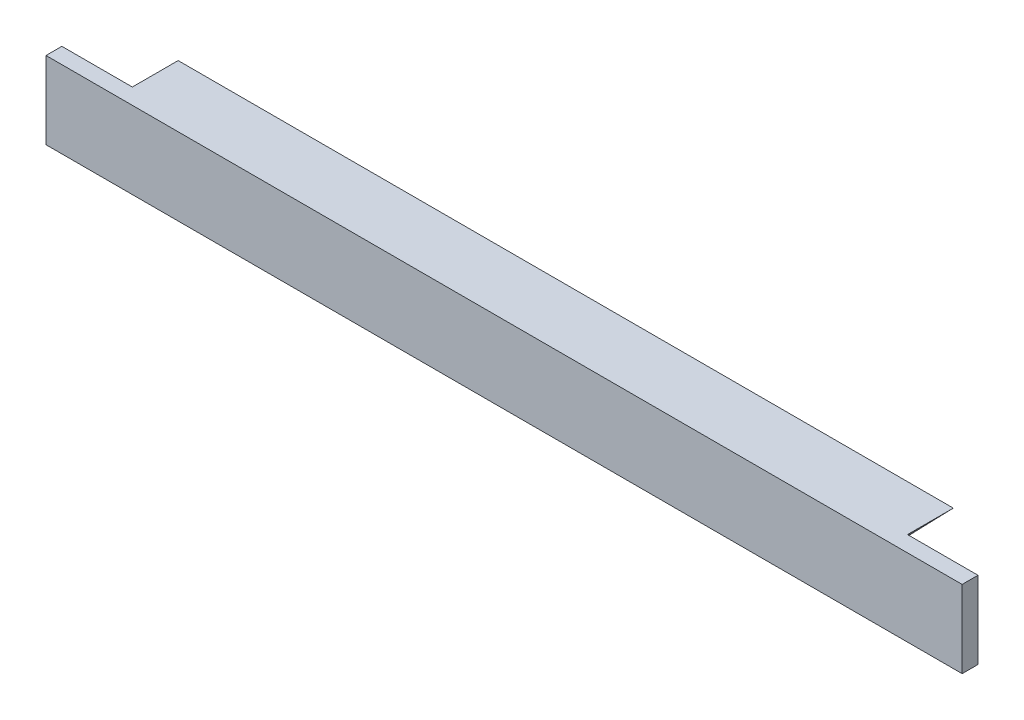
ISO-10303-21;
HEADER;
FILE_DESCRIPTION(('STEP AP214'),'2;1');
FILE_NAME('part.step','',(''),(''),'','','');
FILE_SCHEMA(('AUTOMOTIVE_DESIGN { 1 0 10303 214 1 1 1 1 }'));
ENDSEC;
DATA;
#1=APPLICATION_CONTEXT('core data for automotive mechanical design processes');
#2=APPLICATION_PROTOCOL_DEFINITION('international standard','automotive_design',2000,#1);
#3=PRODUCT_CONTEXT('',#1,'mechanical');
#4=PRODUCT('Part','Part','',(#3));
#5=PRODUCT_RELATED_PRODUCT_CATEGORY('part','',(#4));
#6=PRODUCT_DEFINITION_FORMATION('','',#4);
#7=PRODUCT_DEFINITION_CONTEXT('part definition',#1,'design');
#8=PRODUCT_DEFINITION('design','',#6,#7);
#9=PRODUCT_DEFINITION_SHAPE('','',#8);
#10=(LENGTH_UNIT() NAMED_UNIT(*) SI_UNIT(.MILLI.,.METRE.));
#11=(NAMED_UNIT(*) PLANE_ANGLE_UNIT() SI_UNIT($,.RADIAN.));
#12=(NAMED_UNIT(*) SI_UNIT($,.STERADIAN.) SOLID_ANGLE_UNIT());
#13=UNCERTAINTY_MEASURE_WITH_UNIT(LENGTH_MEASURE(1.E-05),#10,'distance_accuracy_value','');
#14=(GEOMETRIC_REPRESENTATION_CONTEXT(3) GLOBAL_UNCERTAINTY_ASSIGNED_CONTEXT((#13)) GLOBAL_UNIT_ASSIGNED_CONTEXT((#10,
#11,#12)) REPRESENTATION_CONTEXT('',''));
#15=CARTESIAN_POINT('',(0.,0.,0.));
#16=DIRECTION('',(0.,0.,1.));
#17=DIRECTION('',(1.,0.,0.));
#18=AXIS2_PLACEMENT_3D('',#15,#16,#17);
#19=CARTESIAN_POINT('',(-22.,4.38823356566663,2.6));
#20=DIRECTION('',(0.,-1.,0.));
#21=DIRECTION('',(1.,0.,0.));
#22=AXIS2_PLACEMENT_3D('',#19,#20,#21);
#23=PLANE('',#22);
#24=DIRECTION('',(-1.,0.,0.));
#25=VECTOR('',#24,1.);
#26=CARTESIAN_POINT('',(-22.,4.38823356566663,0.));
#27=LINE('',#26,#25);
#28=CARTESIAN_POINT('',(22.,4.38823356566663,0.));
#29=VERTEX_POINT('',#28);
#30=CARTESIAN_POINT('',(-22.,4.38823356566663,0.));
#31=VERTEX_POINT('',#30);
#32=EDGE_CURVE('E152',#29,#31,#27,.T.);
#33=ORIENTED_EDGE('',*,*,#32,.T.);
#34=DIRECTION('',(0.,0.,-1.));
#35=VECTOR('',#34,1.);
#36=CARTESIAN_POINT('',(-22.,4.38823356566663,2.6));
#37=LINE('',#36,#35);
#38=CARTESIAN_POINT('',(-22.,4.38823356566663,2.6));
#39=VERTEX_POINT('',#38);
#40=EDGE_CURVE('E11',#39,#31,#37,.T.);
#41=ORIENTED_EDGE('',*,*,#40,.F.);
#42=DIRECTION('',(-1.,0.,0.));
#43=VECTOR('',#42,1.);
#44=CARTESIAN_POINT('',(26.,4.38823356566663,2.6));
#45=LINE('',#44,#43);
#46=CARTESIAN_POINT('',(-26.,4.38823356566663,2.6));
#47=VERTEX_POINT('',#46);
#48=EDGE_CURVE('E191',#39,#47,#45,.T.);
#49=ORIENTED_EDGE('',*,*,#48,.T.);
#50=DIRECTION('',(0.,0.,-1.));
#51=VECTOR('',#50,1.);
#52=CARTESIAN_POINT('',(-26.,4.38823356566663,3.5));
#53=LINE('',#52,#51);
#54=CARTESIAN_POINT('',(-26.,4.38823356566663,3.5));
#55=VERTEX_POINT('',#54);
#56=EDGE_CURVE('E144',#55,#47,#53,.T.);
#57=ORIENTED_EDGE('',*,*,#56,.F.);
#58=DIRECTION('',(-1.,0.,0.));
#59=VECTOR('',#58,1.);
#60=CARTESIAN_POINT('',(26.,4.38823356566663,3.5));
#61=LINE('',#60,#59);
#62=CARTESIAN_POINT('',(26.,4.38823356566663,3.5));
#63=VERTEX_POINT('',#62);
#64=EDGE_CURVE('E125',#63,#55,#61,.T.);
#65=ORIENTED_EDGE('',*,*,#64,.F.);
#66=DIRECTION('',(0.,0.,-1.));
#67=VECTOR('',#66,1.);
#68=CARTESIAN_POINT('',(26.,4.38823356566663,3.5));
#69=LINE('',#68,#67);
#70=CARTESIAN_POINT('',(26.,4.38823356566663,2.6));
#71=VERTEX_POINT('',#70);
#72=EDGE_CURVE('E132',#63,#71,#69,.T.);
#73=ORIENTED_EDGE('',*,*,#72,.T.);
#74=CARTESIAN_POINT('',(22.,4.38823356566663,2.6));
#75=VERTEX_POINT('',#74);
#76=EDGE_CURVE('E193',#71,#75,#45,.T.);
#77=ORIENTED_EDGE('',*,*,#76,.T.);
#78=DIRECTION('',(0.,0.,-1.));
#79=VECTOR('',#78,1.);
#80=CARTESIAN_POINT('',(22.,4.38823356566663,2.6));
#81=LINE('',#80,#79);
#82=EDGE_CURVE('E174',#75,#29,#81,.T.);
#83=ORIENTED_EDGE('',*,*,#82,.T.);
#84=EDGE_LOOP('',(#33,#41,#49,#57,#65,#73,#77,#83));
#85=FACE_BOUND('',#84,.T.);
#86=ADVANCED_FACE('F33',(#85),#23,.F.);
#87=CARTESIAN_POINT('',(-22.,4.38823356566663,2.6));
#88=DIRECTION('',(0.718330307090637,0.695702213533255,0.));
#89=DIRECTION('',(-0.695702213533255,0.718330307090637,0.));
#90=AXIS2_PLACEMENT_3D('',#87,#88,#89);
#91=PLANE('',#90);
#92=DIRECTION('',(0.695702213533255,-0.718330307090637,0.));
#93=VECTOR('',#92,1.);
#94=CARTESIAN_POINT('',(-22.,4.38823356566663,0.));
#95=LINE('',#94,#93);
#96=CARTESIAN_POINT('',(-18.6341363431077,0.912893359400219,0.));
#97=VERTEX_POINT('',#96);
#98=EDGE_CURVE('E160',#31,#97,#95,.T.);
#99=ORIENTED_EDGE('',*,*,#98,.T.);
#100=DIRECTION('',(0.,0.,-1.));
#101=VECTOR('',#100,1.);
#102=CARTESIAN_POINT('',(-18.6341363431077,0.912893359400219,2.6));
#103=LINE('',#102,#101);
#104=CARTESIAN_POINT('',(-18.6341363431077,0.912893359400219,2.6));
#105=VERTEX_POINT('',#104);
#106=EDGE_CURVE('E42',#105,#97,#103,.T.);
#107=ORIENTED_EDGE('',*,*,#106,.F.);
#108=DIRECTION('',(0.695702213533255,-0.718330307090637,0.));
#109=VECTOR('',#108,1.);
#110=CARTESIAN_POINT('',(-22.,4.38823356566663,2.6));
#111=LINE('',#110,#109);
#112=EDGE_CURVE('E86',#39,#105,#111,.T.);
#113=ORIENTED_EDGE('',*,*,#112,.F.);
#114=ORIENTED_EDGE('',*,*,#40,.T.);
#115=EDGE_LOOP('',(#99,#107,#113,#114));
#116=FACE_BOUND('',#115,.T.);
#117=ADVANCED_FACE('F231',(#116),#91,.F.);
#118=CARTESIAN_POINT('',(-16.4791454218358,2.99999999999999,2.6));
#119=DIRECTION('',(0.,0.,-1.));
#120=DIRECTION('',(-1.,0.,0.));
#121=AXIS2_PLACEMENT_3D('',#118,#119,#120);
#122=CYLINDRICAL_SURFACE('',#121,3.);
#123=CARTESIAN_POINT('',(-16.4791454218358,2.99999999999999,0.));
#124=DIRECTION('',(0.,0.,1.));
#125=DIRECTION('',(1.,0.,0.));
#126=AXIS2_PLACEMENT_3D('',#123,#124,#125);
#127=CIRCLE('',#126,3.);
#128=CARTESIAN_POINT('',(-16.4791454218358,0.,0.));
#129=VERTEX_POINT('',#128);
#130=EDGE_CURVE('E101',#97,#129,#127,.T.);
#131=ORIENTED_EDGE('',*,*,#130,.T.);
#132=DIRECTION('',(0.,0.,-1.));
#133=VECTOR('',#132,1.);
#134=CARTESIAN_POINT('',(-16.4791454218358,0.,2.6));
#135=LINE('',#134,#133);
#136=CARTESIAN_POINT('',(-16.4791454218358,0.,2.6));
#137=VERTEX_POINT('',#136);
#138=EDGE_CURVE('E95',#137,#129,#135,.T.);
#139=ORIENTED_EDGE('',*,*,#138,.F.);
#140=CARTESIAN_POINT('',(-16.4791454218358,2.99999999999999,2.6));
#141=DIRECTION('',(0.,0.,1.));
#142=DIRECTION('',(1.,0.,0.));
#143=AXIS2_PLACEMENT_3D('',#140,#141,#142);
#144=CIRCLE('',#143,3.);
#145=EDGE_CURVE('E99',#105,#137,#144,.T.);
#146=ORIENTED_EDGE('',*,*,#145,.F.);
#147=ORIENTED_EDGE('',*,*,#106,.T.);
#148=EDGE_LOOP('',(#131,#139,#146,#147));
#149=FACE_BOUND('',#148,.T.);
#150=ADVANCED_FACE('F97',(#149),#122,.T.);
#151=CARTESIAN_POINT('',(16.4791454218358,0.,2.6));
#152=DIRECTION('',(0.,1.,0.));
#153=DIRECTION('',(-1.,0.,0.));
#154=AXIS2_PLACEMENT_3D('',#151,#152,#153);
#155=PLANE('',#154);
#156=DIRECTION('',(1.,0.,0.));
#157=VECTOR('',#156,1.);
#158=CARTESIAN_POINT('',(16.4791454218358,0.,0.));
#159=LINE('',#158,#157);
#160=CARTESIAN_POINT('',(16.4791454218358,0.,0.));
#161=VERTEX_POINT('',#160);
#162=EDGE_CURVE('E169',#129,#161,#159,.T.);
#163=ORIENTED_EDGE('',*,*,#162,.T.);
#164=DIRECTION('',(0.,0.,-1.));
#165=VECTOR('',#164,1.);
#166=CARTESIAN_POINT('',(16.4791454218358,0.,2.6));
#167=LINE('',#166,#165);
#168=CARTESIAN_POINT('',(16.4791454218358,0.,2.6));
#169=VERTEX_POINT('',#168);
#170=EDGE_CURVE('E105',#169,#161,#167,.T.);
#171=ORIENTED_EDGE('',*,*,#170,.F.);
#172=DIRECTION('',(1.,0.,0.));
#173=VECTOR('',#172,1.);
#174=CARTESIAN_POINT('',(26.,0.,2.6));
#175=LINE('',#174,#173);
#176=CARTESIAN_POINT('',(26.,0.,2.6));
#177=VERTEX_POINT('',#176);
#178=EDGE_CURVE('E122',#169,#177,#175,.T.);
#179=ORIENTED_EDGE('',*,*,#178,.T.);
#180=DIRECTION('',(0.,0.,-1.));
#181=VECTOR('',#180,1.);
#182=CARTESIAN_POINT('',(26.,0.,3.5));
#183=LINE('',#182,#181);
#184=CARTESIAN_POINT('',(26.,0.,3.5));
#185=VERTEX_POINT('',#184);
#186=EDGE_CURVE('E139',#185,#177,#183,.T.);
#187=ORIENTED_EDGE('',*,*,#186,.F.);
#188=DIRECTION('',(1.,0.,0.));
#189=VECTOR('',#188,1.);
#190=CARTESIAN_POINT('',(26.,0.,3.5));
#191=LINE('',#190,#189);
#192=CARTESIAN_POINT('',(-26.,0.,3.5));
#193=VERTEX_POINT('',#192);
#194=EDGE_CURVE('E143',#193,#185,#191,.T.);
#195=ORIENTED_EDGE('',*,*,#194,.F.);
#196=DIRECTION('',(0.,0.,-1.));
#197=VECTOR('',#196,1.);
#198=CARTESIAN_POINT('',(-26.,0.,3.5));
#199=LINE('',#198,#197);
#200=CARTESIAN_POINT('',(-26.,0.,2.6));
#201=VERTEX_POINT('',#200);
#202=EDGE_CURVE('E120',#193,#201,#199,.T.);
#203=ORIENTED_EDGE('',*,*,#202,.T.);
#204=EDGE_CURVE('E113',#201,#137,#175,.T.);
#205=ORIENTED_EDGE('',*,*,#204,.T.);
#206=ORIENTED_EDGE('',*,*,#138,.T.);
#207=EDGE_LOOP('',(#163,#171,#179,#187,#195,#203,#205,#206));
#208=FACE_BOUND('',#207,.T.);
#209=ADVANCED_FACE('F117',(#208),#155,.F.);
#210=CARTESIAN_POINT('',(16.4791454218358,2.99999999999999,2.6));
#211=DIRECTION('',(0.,0.,-1.));
#212=DIRECTION('',(-1.,0.,0.));
#213=AXIS2_PLACEMENT_3D('',#210,#211,#212);
#214=CYLINDRICAL_SURFACE('',#213,3.);
#215=CARTESIAN_POINT('',(16.4791454218358,2.99999999999999,0.));
#216=DIRECTION('',(0.,0.,1.));
#217=DIRECTION('',(-1.,0.,0.));
#218=AXIS2_PLACEMENT_3D('',#215,#216,#217);
#219=CIRCLE('',#218,3.);
#220=CARTESIAN_POINT('',(18.6341363431077,0.91289335940023,0.));
#221=VERTEX_POINT('',#220);
#222=EDGE_CURVE('E72',#161,#221,#219,.T.);
#223=ORIENTED_EDGE('',*,*,#222,.T.);
#224=DIRECTION('',(0.,0.,-1.));
#225=VECTOR('',#224,1.);
#226=CARTESIAN_POINT('',(18.6341363431077,0.91289335940023,2.6));
#227=LINE('',#226,#225);
#228=CARTESIAN_POINT('',(18.6341363431077,0.91289335940023,2.6));
#229=VERTEX_POINT('',#228);
#230=EDGE_CURVE('E50',#229,#221,#227,.T.);
#231=ORIENTED_EDGE('',*,*,#230,.F.);
#232=CARTESIAN_POINT('',(16.4791454218358,2.99999999999999,2.6));
#233=DIRECTION('',(0.,0.,1.));
#234=DIRECTION('',(-1.,0.,0.));
#235=AXIS2_PLACEMENT_3D('',#232,#233,#234);
#236=CIRCLE('',#235,3.);
#237=EDGE_CURVE('E114',#169,#229,#236,.T.);
#238=ORIENTED_EDGE('',*,*,#237,.F.);
#239=ORIENTED_EDGE('',*,*,#170,.T.);
#240=EDGE_LOOP('',(#223,#231,#238,#239));
#241=FACE_BOUND('',#240,.T.);
#242=ADVANCED_FACE('F241',(#241),#214,.T.);
#243=CARTESIAN_POINT('',(22.,4.38823356566663,2.6));
#244=DIRECTION('',(-0.718330307090638,0.695702213533254,0.));
#245=DIRECTION('',(-0.695702213533254,-0.718330307090638,0.));
#246=AXIS2_PLACEMENT_3D('',#243,#244,#245);
#247=PLANE('',#246);
#248=DIRECTION('',(0.695702213533255,0.718330307090638,0.));
#249=VECTOR('',#248,1.);
#250=CARTESIAN_POINT('',(22.,4.38823356566663,0.));
#251=LINE('',#250,#249);
#252=EDGE_CURVE('E78',#221,#29,#251,.T.);
#253=ORIENTED_EDGE('',*,*,#252,.T.);
#254=ORIENTED_EDGE('',*,*,#82,.F.);
#255=DIRECTION('',(0.695702213533255,0.718330307090638,0.));
#256=VECTOR('',#255,1.);
#257=CARTESIAN_POINT('',(22.,4.38823356566663,2.6));
#258=LINE('',#257,#256);
#259=EDGE_CURVE('E177',#229,#75,#258,.T.);
#260=ORIENTED_EDGE('',*,*,#259,.F.);
#261=ORIENTED_EDGE('',*,*,#230,.T.);
#262=EDGE_LOOP('',(#253,#254,#260,#261));
#263=FACE_BOUND('',#262,.T.);
#264=ADVANCED_FACE('F244',(#263),#247,.F.);
#265=CARTESIAN_POINT('',(16.4791454218358,2.99999999999999,0.));
#266=DIRECTION('',(0.,0.,-1.));
#267=DIRECTION('',(-1.,0.,0.));
#268=AXIS2_PLACEMENT_3D('',#265,#266,#267);
#269=PLANE('',#268);
#270=ORIENTED_EDGE('',*,*,#32,.F.);
#271=ORIENTED_EDGE('',*,*,#252,.F.);
#272=ORIENTED_EDGE('',*,*,#222,.F.);
#273=ORIENTED_EDGE('',*,*,#162,.F.);
#274=ORIENTED_EDGE('',*,*,#130,.F.);
#275=ORIENTED_EDGE('',*,*,#98,.F.);
#276=EDGE_LOOP('',(#270,#271,#272,#273,#274,#275));
#277=FACE_BOUND('',#276,.T.);
#278=ADVANCED_FACE('F230',(#277),#269,.T.);
#279=CARTESIAN_POINT('',(0.,0.,2.6));
#280=DIRECTION('',(0.,0.,-1.));
#281=DIRECTION('',(-1.,0.,0.));
#282=AXIS2_PLACEMENT_3D('',#279,#280,#281);
#283=PLANE('',#282);
#284=ORIENTED_EDGE('',*,*,#48,.F.);
#285=ORIENTED_EDGE('',*,*,#112,.T.);
#286=ORIENTED_EDGE('',*,*,#145,.T.);
#287=ORIENTED_EDGE('',*,*,#204,.F.);
#288=DIRECTION('',(0.,-1.,0.));
#289=VECTOR('',#288,1.);
#290=CARTESIAN_POINT('',(-26.,4.38823356566663,2.6));
#291=LINE('',#290,#289);
#292=EDGE_CURVE('E128',#47,#201,#291,.T.);
#293=ORIENTED_EDGE('',*,*,#292,.F.);
#294=EDGE_LOOP('',(#284,#285,#286,#287,#293));
#295=FACE_BOUND('',#294,.T.);
#296=ADVANCED_FACE('F110',(#295),#283,.T.);
#297=CARTESIAN_POINT('',(26.,4.38823356566663,3.5));
#298=DIRECTION('',(-1.,0.,0.));
#299=DIRECTION('',(0.,0.,1.));
#300=AXIS2_PLACEMENT_3D('',#297,#298,#299);
#301=PLANE('',#300);
#302=DIRECTION('',(0.,1.,0.));
#303=VECTOR('',#302,1.);
#304=CARTESIAN_POINT('',(26.,4.38823356566663,2.6));
#305=LINE('',#304,#303);
#306=EDGE_CURVE('E194',#177,#71,#305,.T.);
#307=ORIENTED_EDGE('',*,*,#306,.T.);
#308=ORIENTED_EDGE('',*,*,#72,.F.);
#309=DIRECTION('',(0.,1.,0.));
#310=VECTOR('',#309,1.);
#311=CARTESIAN_POINT('',(26.,4.38823356566663,3.5));
#312=LINE('',#311,#310);
#313=EDGE_CURVE('E121',#185,#63,#312,.T.);
#314=ORIENTED_EDGE('',*,*,#313,.F.);
#315=ORIENTED_EDGE('',*,*,#186,.T.);
#316=EDGE_LOOP('',(#307,#308,#314,#315));
#317=FACE_BOUND('',#316,.T.);
#318=ADVANCED_FACE('F227',(#317),#301,.F.);
#319=CARTESIAN_POINT('',(-26.,4.38823356566663,3.5));
#320=DIRECTION('',(1.,0.,0.));
#321=DIRECTION('',(0.,1.,0.));
#322=AXIS2_PLACEMENT_3D('',#319,#320,#321);
#323=PLANE('',#322);
#324=ORIENTED_EDGE('',*,*,#292,.T.);
#325=ORIENTED_EDGE('',*,*,#202,.F.);
#326=DIRECTION('',(0.,-1.,0.));
#327=VECTOR('',#326,1.);
#328=CARTESIAN_POINT('',(-26.,4.38823356566663,3.5));
#329=LINE('',#328,#327);
#330=EDGE_CURVE('E201',#55,#193,#329,.T.);
#331=ORIENTED_EDGE('',*,*,#330,.F.);
#332=ORIENTED_EDGE('',*,*,#56,.T.);
#333=EDGE_LOOP('',(#324,#325,#331,#332));
#334=FACE_BOUND('',#333,.T.);
#335=ADVANCED_FACE('F212',(#334),#323,.F.);
#336=CARTESIAN_POINT('',(0.,0.,3.5));
#337=DIRECTION('',(0.,0.,-1.));
#338=DIRECTION('',(-1.,0.,0.));
#339=AXIS2_PLACEMENT_3D('',#336,#337,#338);
#340=PLANE('',#339);
#341=ORIENTED_EDGE('',*,*,#313,.T.);
#342=ORIENTED_EDGE('',*,*,#64,.T.);
#343=ORIENTED_EDGE('',*,*,#330,.T.);
#344=ORIENTED_EDGE('',*,*,#194,.T.);
#345=EDGE_LOOP('',(#341,#342,#343,#344));
#346=FACE_BOUND('',#345,.T.);
#347=ADVANCED_FACE('F207',(#346),#340,.F.);
#348=ORIENTED_EDGE('',*,*,#178,.F.);
#349=ORIENTED_EDGE('',*,*,#237,.T.);
#350=ORIENTED_EDGE('',*,*,#259,.T.);
#351=ORIENTED_EDGE('',*,*,#76,.F.);
#352=ORIENTED_EDGE('',*,*,#306,.F.);
#353=EDGE_LOOP('',(#348,#349,#350,#351,#352));
#354=FACE_BOUND('',#353,.T.);
#355=ADVANCED_FACE('F228',(#354),#283,.T.);
#356=CLOSED_SHELL('',(#86,#117,#150,#209,#242,#264,#278,#296,#318,#335,#347,#355));
#357=MANIFOLD_SOLID_BREP('B2',#356);
#358=ADVANCED_BREP_SHAPE_REPRESENTATION('',(#18,#357),#14);
#359=SHAPE_DEFINITION_REPRESENTATION(#9,#358);
ENDSEC;
END-ISO-10303-21;
